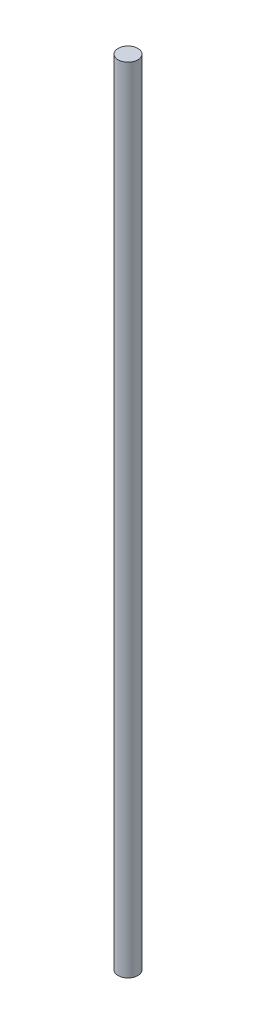
ISO-10303-21;
HEADER;
FILE_DESCRIPTION(('STEP AP214'),'2;1');
FILE_NAME('part.step','',(''),(''),'','','');
FILE_SCHEMA(('AUTOMOTIVE_DESIGN { 1 0 10303 214 1 1 1 1 }'));
ENDSEC;
DATA;
#1=APPLICATION_CONTEXT('core data for automotive mechanical design processes');
#2=APPLICATION_PROTOCOL_DEFINITION('international standard','automotive_design',2000,#1);
#3=PRODUCT_CONTEXT('',#1,'mechanical');
#4=PRODUCT('Part','Part','',(#3));
#5=PRODUCT_RELATED_PRODUCT_CATEGORY('part','',(#4));
#6=PRODUCT_DEFINITION_FORMATION('','',#4);
#7=PRODUCT_DEFINITION_CONTEXT('part definition',#1,'design');
#8=PRODUCT_DEFINITION('design','',#6,#7);
#9=PRODUCT_DEFINITION_SHAPE('','',#8);
#10=(LENGTH_UNIT() NAMED_UNIT(*) SI_UNIT(.MILLI.,.METRE.));
#11=(NAMED_UNIT(*) PLANE_ANGLE_UNIT() SI_UNIT($,.RADIAN.));
#12=(NAMED_UNIT(*) SI_UNIT($,.STERADIAN.) SOLID_ANGLE_UNIT());
#13=UNCERTAINTY_MEASURE_WITH_UNIT(LENGTH_MEASURE(1.E-05),#10,'distance_accuracy_value','');
#14=(GEOMETRIC_REPRESENTATION_CONTEXT(3) GLOBAL_UNCERTAINTY_ASSIGNED_CONTEXT((#13)) GLOBAL_UNIT_ASSIGNED_CONTEXT((#10,
#11,#12)) REPRESENTATION_CONTEXT('',''));
#15=CARTESIAN_POINT('',(0.,0.,0.));
#16=DIRECTION('',(0.,0.,1.));
#17=DIRECTION('',(1.,0.,0.));
#18=AXIS2_PLACEMENT_3D('',#15,#16,#17);
#19=CARTESIAN_POINT('',(0.,254.,0.));
#20=DIRECTION('',(0.,-1.,0.));
#21=DIRECTION('',(0.,0.,-1.));
#22=AXIS2_PLACEMENT_3D('',#19,#20,#21);
#23=CYLINDRICAL_SURFACE('',#22,3.175);
#24=CARTESIAN_POINT('',(0.,254.,0.));
#25=DIRECTION('',(0.,1.,0.));
#26=DIRECTION('',(0.,0.,1.));
#27=AXIS2_PLACEMENT_3D('',#24,#25,#26);
#28=CIRCLE('',#27,3.175);
#29=CARTESIAN_POINT('',(0.,254.,3.175));
#30=VERTEX_POINT('',#29);
#31=EDGE_CURVE('E10',#30,#30,#28,.T.);
#32=ORIENTED_EDGE('',*,*,#31,.F.);
#33=EDGE_LOOP('',(#32));
#34=FACE_BOUND('',#33,.T.);
#35=CARTESIAN_POINT('',(0.,0.,0.));
#36=DIRECTION('',(0.,1.,0.));
#37=DIRECTION('',(0.,0.,1.));
#38=AXIS2_PLACEMENT_3D('',#35,#36,#37);
#39=CIRCLE('',#38,3.175);
#40=CARTESIAN_POINT('',(0.,0.,3.175));
#41=VERTEX_POINT('',#40);
#42=EDGE_CURVE('E35',#41,#41,#39,.T.);
#43=ORIENTED_EDGE('',*,*,#42,.T.);
#44=EDGE_LOOP('',(#43));
#45=FACE_BOUND('',#44,.T.);
#46=ADVANCED_FACE('F32',(#34,#45),#23,.T.);
#47=CARTESIAN_POINT('',(0.,254.,0.));
#48=DIRECTION('',(0.,1.,0.));
#49=DIRECTION('',(0.,0.,1.));
#50=AXIS2_PLACEMENT_3D('',#47,#48,#49);
#51=PLANE('',#50);
#52=ORIENTED_EDGE('',*,*,#31,.T.);
#53=EDGE_LOOP('',(#52));
#54=FACE_BOUND('',#53,.T.);
#55=ADVANCED_FACE('F47',(#54),#51,.T.);
#56=CARTESIAN_POINT('',(0.,0.,0.));
#57=DIRECTION('',(0.,1.,0.));
#58=DIRECTION('',(0.,0.,1.));
#59=AXIS2_PLACEMENT_3D('',#56,#57,#58);
#60=PLANE('',#59);
#61=ORIENTED_EDGE('',*,*,#42,.F.);
#62=EDGE_LOOP('',(#61));
#63=FACE_BOUND('',#62,.T.);
#64=ADVANCED_FACE('F45',(#63),#60,.F.);
#65=CLOSED_SHELL('',(#46,#55,#64));
#66=MANIFOLD_SOLID_BREP('B2',#65);
#67=ADVANCED_BREP_SHAPE_REPRESENTATION('',(#18,#66),#14);
#68=SHAPE_DEFINITION_REPRESENTATION(#9,#67);
ENDSEC;
END-ISO-10303-21;
